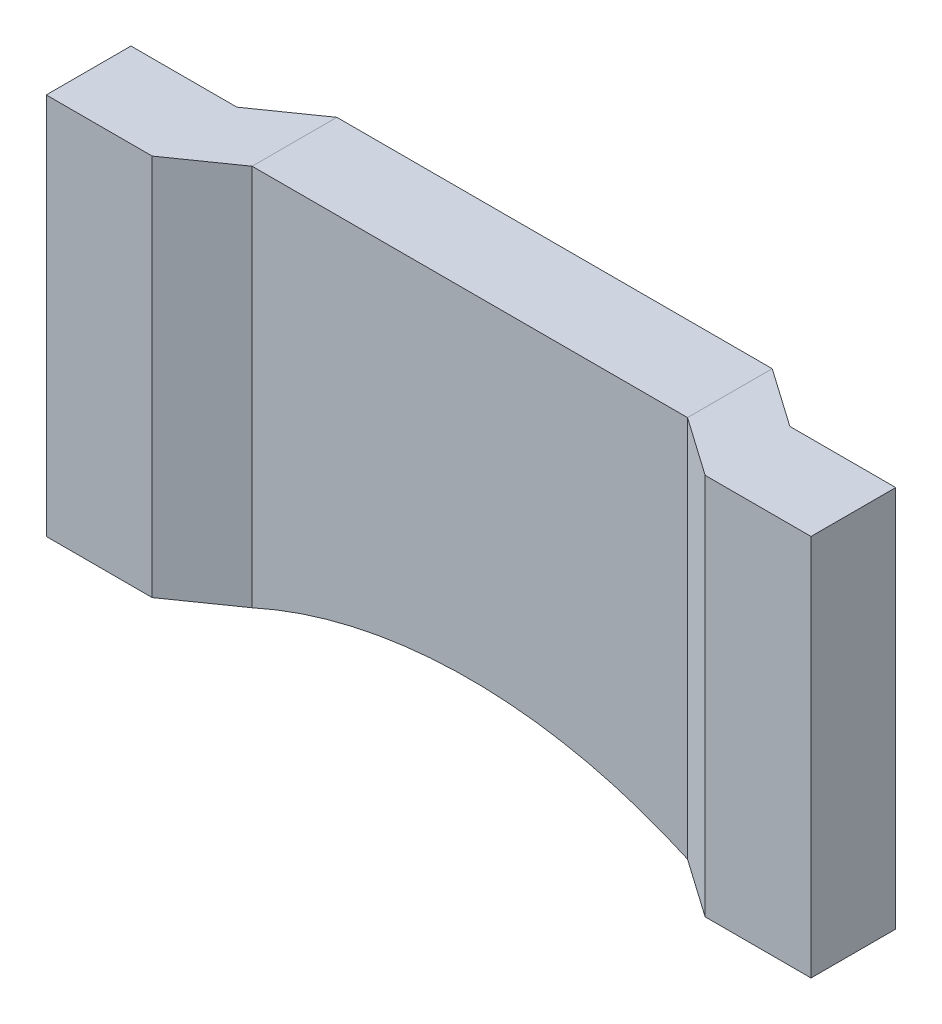
ISO-10303-21;
HEADER;
FILE_DESCRIPTION(('STEP AP214'),'2;1');
FILE_NAME('part.step','',(''),(''),'','','');
FILE_SCHEMA(('AUTOMOTIVE_DESIGN { 1 0 10303 214 1 1 1 1 }'));
ENDSEC;
DATA;
#1=APPLICATION_CONTEXT('core data for automotive mechanical design processes');
#2=APPLICATION_PROTOCOL_DEFINITION('international standard','automotive_design',2000,#1);
#3=PRODUCT_CONTEXT('',#1,'mechanical');
#4=PRODUCT('Part','Part','',(#3));
#5=PRODUCT_RELATED_PRODUCT_CATEGORY('part','',(#4));
#6=PRODUCT_DEFINITION_FORMATION('','',#4);
#7=PRODUCT_DEFINITION_CONTEXT('part definition',#1,'design');
#8=PRODUCT_DEFINITION('design','',#6,#7);
#9=PRODUCT_DEFINITION_SHAPE('','',#8);
#10=(LENGTH_UNIT() NAMED_UNIT(*) SI_UNIT(.MILLI.,.METRE.));
#11=(NAMED_UNIT(*) PLANE_ANGLE_UNIT() SI_UNIT($,.RADIAN.));
#12=(NAMED_UNIT(*) SI_UNIT($,.STERADIAN.) SOLID_ANGLE_UNIT());
#13=UNCERTAINTY_MEASURE_WITH_UNIT(LENGTH_MEASURE(1.E-05),#10,'distance_accuracy_value','');
#14=(GEOMETRIC_REPRESENTATION_CONTEXT(3) GLOBAL_UNCERTAINTY_ASSIGNED_CONTEXT((#13)) GLOBAL_UNIT_ASSIGNED_CONTEXT((#10,
#11,#12)) REPRESENTATION_CONTEXT('',''));
#15=CARTESIAN_POINT('',(0.,0.,0.));
#16=DIRECTION('',(0.,0.,1.));
#17=DIRECTION('',(1.,0.,0.));
#18=AXIS2_PLACEMENT_3D('',#15,#16,#17);
#19=CARTESIAN_POINT('',(19.8721310893276,-6.80902815420886,-0.547780344865948));
#20=DIRECTION('',(-8.74227765734793E-08,-1.,-4.37114091299597E-08));
#21=DIRECTION('',(-1.,8.74227765734794E-08,0.));
#22=AXIS2_PLACEMENT_3D('',#19,#20,#21);
#23=PLANE('',#22);
#24=DIRECTION('',(0.819152044289011,-4.6540711870944E-08,-0.573576436351015));
#25=VECTOR('',#24,1.);
#26=CARTESIAN_POINT('',(19.6222051881476,-6.80902812427303,-0.732780344865945));
#27=LINE('',#26,#25);
#28=CARTESIAN_POINT('',(19.6222051881476,-6.80902812427303,-0.732780344865945));
#29=VERTEX_POINT('',#28);
#30=CARTESIAN_POINT('',(20.1220569905076,-6.80902815267248,-1.08278034486595));
#31=VERTEX_POINT('',#30);
#32=EDGE_CURVE('P0_E27',#29,#31,#27,.T.);
#33=ORIENTED_EDGE('',*,*,#32,.F.);
#34=DIRECTION('',(1.,-8.74227765734794E-08,0.));
#35=VECTOR('',#34,1.);
#36=CARTESIAN_POINT('',(18.7222051881476,-6.80902804559254,-0.732780344865939));
#37=LINE('',#36,#35);
#38=CARTESIAN_POINT('',(18.7222051881476,-6.80902804559254,-0.732780344865939));
#39=VERTEX_POINT('',#38);
#40=EDGE_CURVE('P0_E147',#39,#29,#37,.T.);
#41=ORIENTED_EDGE('',*,*,#40,.F.);
#42=DIRECTION('',(0.,4.37114091299602E-08,-1.));
#43=VECTOR('',#42,1.);
#44=CARTESIAN_POINT('',(18.7222051881476,-6.80902807706475,-0.0127803448659405));
#45=LINE('',#44,#43);
#46=CARTESIAN_POINT('',(18.7222051881476,-6.80902807706475,-0.0127803448659405));
#47=VERTEX_POINT('',#46);
#48=EDGE_CURVE('P0_E65',#47,#39,#45,.T.);
#49=ORIENTED_EDGE('',*,*,#48,.F.);
#50=DIRECTION('',(-1.,8.74227765734794E-08,0.));
#51=VECTOR('',#50,1.);
#52=CARTESIAN_POINT('',(19.6222051881476,-6.80902815574525,-0.0127803448659474));
#53=LINE('',#52,#51);
#54=CARTESIAN_POINT('',(19.6222051881476,-6.80902815574525,-0.0127803448659474));
#55=VERTEX_POINT('',#54);
#56=EDGE_CURVE('P0_E157',#55,#47,#53,.T.);
#57=ORIENTED_EDGE('',*,*,#56,.F.);
#58=DIRECTION('',(-0.819152044289011,4.6540711870944E-08,0.573576436351015));
#59=VECTOR('',#58,1.);
#60=CARTESIAN_POINT('',(20.1220569905076,-6.80902818414469,-0.36278034486595));
#61=LINE('',#60,#59);
#62=CARTESIAN_POINT('',(20.1220569905076,-6.80902818414469,-0.36278034486595));
#63=VERTEX_POINT('',#62);
#64=EDGE_CURVE('P0_E115',#63,#55,#61,.T.);
#65=ORIENTED_EDGE('',*,*,#64,.F.);
#66=DIRECTION('',(0.,-4.37114091299602E-08,1.));
#67=VECTOR('',#66,1.);
#68=CARTESIAN_POINT('',(20.1220569905076,-6.80902815267248,-1.08278034486595));
#69=LINE('',#68,#67);
#70=EDGE_CURVE('P0_E101',#31,#63,#69,.T.);
#71=ORIENTED_EDGE('',*,*,#70,.F.);
#72=EDGE_LOOP('',(#33,#41,#49,#57,#65,#71));
#73=FACE_BOUND('',#72,.T.);
#74=ADVANCED_FACE('P0_F17',(#73),#23,.F.);
#75=CARTESIAN_POINT('',(19.8721308052035,-10.0590281542088,-0.547780486928027));
#76=DIRECTION('',(-8.74227765734793E-08,-1.,-4.37114091299597E-08));
#77=DIRECTION('',(-1.,8.74227765734794E-08,0.));
#78=AXIS2_PLACEMENT_3D('',#75,#76,#77);
#79=PLANE('',#78);
#80=DIRECTION('',(0.819152044289011,-4.6540711870944E-08,-0.573576436351015));
#81=VECTOR('',#80,1.);
#82=CARTESIAN_POINT('',(19.6222049040236,-10.059028124273,-0.732780486928025));
#83=LINE('',#82,#81);
#84=CARTESIAN_POINT('',(19.6222049040236,-10.059028124273,-0.732780486928025));
#85=VERTEX_POINT('',#84);
#86=CARTESIAN_POINT('',(20.1220567063836,-10.0590281526725,-1.08278048692803));
#87=VERTEX_POINT('',#86);
#88=EDGE_CURVE('P0_E11',#85,#87,#83,.T.);
#89=ORIENTED_EDGE('',*,*,#88,.T.);
#90=DIRECTION('',(0.,-4.37114091299602E-08,1.));
#91=VECTOR('',#90,1.);
#92=CARTESIAN_POINT('',(20.1220567063836,-10.0590281526725,-1.08278048692803));
#93=LINE('',#92,#91);
#94=CARTESIAN_POINT('',(20.1220567063836,-10.0590281841447,-0.36278048692803));
#95=VERTEX_POINT('',#94);
#96=EDGE_CURVE('P0_E90',#87,#95,#93,.T.);
#97=ORIENTED_EDGE('',*,*,#96,.T.);
#98=DIRECTION('',(-0.819152044289011,4.6540711870944E-08,0.573576436351015));
#99=VECTOR('',#98,1.);
#100=CARTESIAN_POINT('',(20.1220567063836,-10.0590281841447,-0.36278048692803));
#101=LINE('',#100,#99);
#102=CARTESIAN_POINT('',(19.6222049040236,-10.0590281557452,-0.0127804869280274));
#103=VERTEX_POINT('',#102);
#104=EDGE_CURVE('P0_E95',#95,#103,#101,.T.);
#105=ORIENTED_EDGE('',*,*,#104,.T.);
#106=DIRECTION('',(-1.,8.74227765734794E-08,0.));
#107=VECTOR('',#106,1.);
#108=CARTESIAN_POINT('',(19.6222049040236,-10.0590281557452,-0.0127804869280274));
#109=LINE('',#108,#107);
#110=CARTESIAN_POINT('',(18.7222049040235,-10.0590280770647,-0.0127804869280205));
#111=VERTEX_POINT('',#110);
#112=EDGE_CURVE('P0_E126',#103,#111,#109,.T.);
#113=ORIENTED_EDGE('',*,*,#112,.T.);
#114=DIRECTION('',(0.,4.37114091299602E-08,-1.));
#115=VECTOR('',#114,1.);
#116=CARTESIAN_POINT('',(18.7222049040235,-10.0590280770647,-0.0127804869280205));
#117=LINE('',#116,#115);
#118=CARTESIAN_POINT('',(18.7222049040235,-10.0590280455925,-0.732780486928018));
#119=VERTEX_POINT('',#118);
#120=EDGE_CURVE('P0_E119',#111,#119,#117,.T.);
#121=ORIENTED_EDGE('',*,*,#120,.T.);
#122=DIRECTION('',(1.,-8.74227765734794E-08,0.));
#123=VECTOR('',#122,1.);
#124=CARTESIAN_POINT('',(18.7222049040235,-10.0590280455925,-0.732780486928018));
#125=LINE('',#124,#123);
#126=EDGE_CURVE('P0_E136',#119,#85,#125,.T.);
#127=ORIENTED_EDGE('',*,*,#126,.T.);
#128=EDGE_LOOP('',(#89,#97,#105,#113,#121,#127));
#129=FACE_BOUND('',#128,.T.);
#130=ADVANCED_FACE('P0_F92',(#129),#79,.T.);
#131=CARTESIAN_POINT('',(19.6222051881476,-6.80902812427303,-0.732780344865945));
#132=DIRECTION('',(-0.573576436351012,8.59499347904874E-08,-0.819152044289009));
#133=DIRECTION('',(0.819152044289011,-4.6540711870944E-08,-0.573576436351015));
#134=AXIS2_PLACEMENT_3D('',#131,#132,#133);
#135=PLANE('',#134);
#136=ORIENTED_EDGE('',*,*,#32,.T.);
#137=DIRECTION('',(-8.74227765734793E-08,-1.,-4.37114091299597E-08));
#138=VECTOR('',#137,1.);
#139=CARTESIAN_POINT('',(20.1220569905076,-6.80902815267248,-1.08278034486595));
#140=LINE('',#139,#138);
#141=EDGE_CURVE('P0_E100',#31,#87,#140,.T.);
#142=ORIENTED_EDGE('',*,*,#141,.T.);
#143=ORIENTED_EDGE('',*,*,#88,.F.);
#144=DIRECTION('',(-8.74227765734793E-08,-1.,-4.37114091299597E-08));
#145=VECTOR('',#144,1.);
#146=CARTESIAN_POINT('',(19.6222051881476,-6.80902812427303,-0.732780344865945));
#147=LINE('',#146,#145);
#148=EDGE_CURVE('P0_E140',#29,#85,#147,.T.);
#149=ORIENTED_EDGE('',*,*,#148,.F.);
#150=EDGE_LOOP('',(#136,#142,#143,#149));
#151=FACE_BOUND('',#150,.T.);
#152=ADVANCED_FACE('P0_F195',(#151),#135,.T.);
#153=CARTESIAN_POINT('',(20.1220569905076,-6.80902815267248,-1.08278034486595));
#154=DIRECTION('',(1.,-8.74227765734794E-08,0.));
#155=DIRECTION('',(0.,-4.37114091299602E-08,1.));
#156=AXIS2_PLACEMENT_3D('',#153,#154,#155);
#157=PLANE('',#156);
#158=ORIENTED_EDGE('',*,*,#70,.T.);
#159=DIRECTION('',(-8.74227765734793E-08,-1.,-4.37114091299597E-08));
#160=VECTOR('',#159,1.);
#161=CARTESIAN_POINT('',(20.1220569905076,-6.80902818414469,-0.36278034486595));
#162=LINE('',#161,#160);
#163=EDGE_CURVE('P0_E104',#63,#95,#162,.T.);
#164=ORIENTED_EDGE('',*,*,#163,.T.);
#165=ORIENTED_EDGE('',*,*,#96,.F.);
#166=ORIENTED_EDGE('',*,*,#141,.F.);
#167=EDGE_LOOP('',(#158,#164,#165,#166));
#168=FACE_BOUND('',#167,.T.);
#169=ADVANCED_FACE('P0_F105',(#168),#157,.T.);
#170=CARTESIAN_POINT('',(20.1220569905076,-6.80902818414469,-0.36278034486595));
#171=DIRECTION('',(0.573576436351012,-8.59499347904874E-08,0.819152044289009));
#172=DIRECTION('',(-0.819152044289011,4.6540711870944E-08,0.573576436351015));
#173=AXIS2_PLACEMENT_3D('',#170,#171,#172);
#174=PLANE('',#173);
#175=ORIENTED_EDGE('',*,*,#64,.T.);
#176=DIRECTION('',(-8.74227765734793E-08,-1.,-4.37114091299597E-08));
#177=VECTOR('',#176,1.);
#178=CARTESIAN_POINT('',(19.6222051881476,-6.80902815574525,-0.0127803448659474));
#179=LINE('',#178,#177);
#180=EDGE_CURVE('P0_E112',#55,#103,#179,.T.);
#181=ORIENTED_EDGE('',*,*,#180,.T.);
#182=ORIENTED_EDGE('',*,*,#104,.F.);
#183=ORIENTED_EDGE('',*,*,#163,.F.);
#184=EDGE_LOOP('',(#175,#181,#182,#183));
#185=FACE_BOUND('',#184,.T.);
#186=ADVANCED_FACE('P0_F110',(#185),#174,.T.);
#187=CARTESIAN_POINT('',(18.7222051881476,-6.80902807706475,-0.0127803448659405));
#188=DIRECTION('',(-1.,8.74227765734794E-08,0.));
#189=DIRECTION('',(0.,4.37114091299602E-08,-1.));
#190=AXIS2_PLACEMENT_3D('',#187,#188,#189);
#191=PLANE('',#190);
#192=ORIENTED_EDGE('',*,*,#48,.T.);
#193=DIRECTION('',(-8.74227765734793E-08,-1.,-4.37114091299597E-08));
#194=VECTOR('',#193,1.);
#195=CARTESIAN_POINT('',(18.7222051881476,-6.80902804559254,-0.732780344865939));
#196=LINE('',#195,#194);
#197=EDGE_CURVE('P0_E139',#39,#119,#196,.T.);
#198=ORIENTED_EDGE('',*,*,#197,.T.);
#199=ORIENTED_EDGE('',*,*,#120,.F.);
#200=DIRECTION('',(-8.74227765734793E-08,-1.,-4.37114091299597E-08));
#201=VECTOR('',#200,1.);
#202=CARTESIAN_POINT('',(18.7222051881476,-6.80902807706475,-0.0127803448659405));
#203=LINE('',#202,#201);
#204=EDGE_CURVE('P0_E129',#47,#111,#203,.T.);
#205=ORIENTED_EDGE('',*,*,#204,.F.);
#206=EDGE_LOOP('',(#192,#198,#199,#205));
#207=FACE_BOUND('',#206,.T.);
#208=ADVANCED_FACE('P0_F197',(#207),#191,.T.);
#209=CARTESIAN_POINT('',(18.7222051881476,-6.80902804559254,-0.732780344865939));
#210=DIRECTION('',(0.,4.37114091299602E-08,-1.));
#211=DIRECTION('',(1.,-8.74227765734794E-08,0.));
#212=AXIS2_PLACEMENT_3D('',#209,#210,#211);
#213=PLANE('',#212);
#214=ORIENTED_EDGE('',*,*,#40,.T.);
#215=ORIENTED_EDGE('',*,*,#148,.T.);
#216=ORIENTED_EDGE('',*,*,#126,.F.);
#217=ORIENTED_EDGE('',*,*,#197,.F.);
#218=EDGE_LOOP('',(#214,#215,#216,#217));
#219=FACE_BOUND('',#218,.T.);
#220=ADVANCED_FACE('P0_F194',(#219),#213,.T.);
#221=CARTESIAN_POINT('',(19.6222051881476,-6.80902815574525,-0.0127803448659474));
#222=DIRECTION('',(0.,-4.37114091299602E-08,1.));
#223=DIRECTION('',(-1.,8.74227765734794E-08,0.));
#224=AXIS2_PLACEMENT_3D('',#221,#222,#223);
#225=PLANE('',#224);
#226=ORIENTED_EDGE('',*,*,#56,.T.);
#227=ORIENTED_EDGE('',*,*,#204,.T.);
#228=ORIENTED_EDGE('',*,*,#112,.F.);
#229=ORIENTED_EDGE('',*,*,#180,.F.);
#230=EDGE_LOOP('',(#226,#227,#228,#229));
#231=FACE_BOUND('',#230,.T.);
#232=ADVANCED_FACE('P0_F268',(#231),#225,.T.);
#233=CLOSED_SHELL('',(#74,#130,#152,#169,#186,#208,#220,#232));
#234=MANIFOLD_SOLID_BREP('P0_B1',#233);
#235=CARTESIAN_POINT('',(24.0722792869676,-6.80902852139748,-0.54778034486598));
#236=DIRECTION('',(-8.74227765734793E-08,-1.,-4.37114091299597E-08));
#237=DIRECTION('',(-1.,8.74227765734794E-08,0.));
#238=AXIS2_PLACEMENT_3D('',#235,#236,#237);
#239=PLANE('',#238);
#240=DIRECTION('',(0.819152044289016,-9.66843804242312E-08,0.573576436351003));
#241=VECTOR('',#240,1.);
#242=CARTESIAN_POINT('',(23.8223533857876,-6.80902847616266,-1.08278034486598));
#243=LINE('',#242,#241);
#244=CARTESIAN_POINT('',(23.8223533857876,-6.80902847616266,-1.08278034486598));
#245=VERTEX_POINT('',#244);
#246=CARTESIAN_POINT('',(24.3222051881475,-6.80902853516008,-0.732780344865981));
#247=VERTEX_POINT('',#246);
#248=EDGE_CURVE('P1_E96',#245,#247,#243,.T.);
#249=ORIENTED_EDGE('',*,*,#248,.F.);
#250=DIRECTION('',(0.,4.37114091299602E-08,-1.));
#251=VECTOR('',#250,1.);
#252=CARTESIAN_POINT('',(23.8223533857876,-6.80902850763487,-0.362780344865978));
#253=LINE('',#252,#251);
#254=CARTESIAN_POINT('',(23.8223533857876,-6.80902850763487,-0.362780344865978));
#255=VERTEX_POINT('',#254);
#256=EDGE_CURVE('P1_E82',#255,#245,#253,.T.);
#257=ORIENTED_EDGE('',*,*,#256,.F.);
#258=DIRECTION('',(-0.819152044289016,9.66843804242312E-08,-0.573576436351003));
#259=VECTOR('',#258,1.);
#260=CARTESIAN_POINT('',(24.3222051881476,-6.80902856663231,-0.0127803448659834));
#261=LINE('',#260,#259);
#262=CARTESIAN_POINT('',(24.3222051881476,-6.80902856663231,-0.0127803448659834));
#263=VERTEX_POINT('',#262);
#264=EDGE_CURVE('P1_E27',#263,#255,#261,.T.);
#265=ORIENTED_EDGE('',*,*,#264,.F.);
#266=DIRECTION('',(-1.,8.74227765734794E-08,0.));
#267=VECTOR('',#266,1.);
#268=CARTESIAN_POINT('',(25.2222051881476,-6.8090286453128,-0.0127803448659904));
#269=LINE('',#268,#267);
#270=CARTESIAN_POINT('',(25.2222051881476,-6.8090286453128,-0.0127803448659904));
#271=VERTEX_POINT('',#270);
#272=EDGE_CURVE('P1_E136',#271,#263,#269,.T.);
#273=ORIENTED_EDGE('',*,*,#272,.F.);
#274=DIRECTION('',(0.,-4.37114091299602E-08,1.));
#275=VECTOR('',#274,1.);
#276=CARTESIAN_POINT('',(25.2222051881476,-6.80902861384058,-0.732780344865988));
#277=LINE('',#276,#275);
#278=CARTESIAN_POINT('',(25.2222051881476,-6.80902861384058,-0.732780344865988));
#279=VERTEX_POINT('',#278);
#280=EDGE_CURVE('P1_E142',#279,#271,#277,.T.);
#281=ORIENTED_EDGE('',*,*,#280,.F.);
#282=DIRECTION('',(1.,-8.74227765734794E-08,0.));
#283=VECTOR('',#282,1.);
#284=CARTESIAN_POINT('',(24.3222051881475,-6.80902853516008,-0.732780344865981));
#285=LINE('',#284,#283);
#286=EDGE_CURVE('P1_E110',#247,#279,#285,.T.);
#287=ORIENTED_EDGE('',*,*,#286,.F.);
#288=EDGE_LOOP('',(#249,#257,#265,#273,#281,#287));
#289=FACE_BOUND('',#288,.T.);
#290=ADVANCED_FACE('P1_F17',(#289),#239,.F.);
#291=CARTESIAN_POINT('',(24.0722790028435,-10.0590285213975,-0.547780486928059));
#292=DIRECTION('',(-8.74227765734793E-08,-1.,-4.37114091299597E-08));
#293=DIRECTION('',(-1.,8.74227765734794E-08,0.));
#294=AXIS2_PLACEMENT_3D('',#291,#292,#293);
#295=PLANE('',#294);
#296=DIRECTION('',(-0.819152044289016,9.66843804242312E-08,-0.573576436351003));
#297=VECTOR('',#296,1.);
#298=CARTESIAN_POINT('',(24.3222049040236,-10.0590285666323,-0.012780486928063));
#299=LINE('',#298,#297);
#300=CARTESIAN_POINT('',(24.3222049040236,-10.0590285666323,-0.012780486928063));
#301=VERTEX_POINT('',#300);
#302=CARTESIAN_POINT('',(23.8223531016635,-10.0590285076349,-0.362780486928059));
#303=VERTEX_POINT('',#302);
#304=EDGE_CURVE('P1_E11',#301,#303,#299,.T.);
#305=ORIENTED_EDGE('',*,*,#304,.T.);
#306=DIRECTION('',(0.,4.37114091299602E-08,-1.));
#307=VECTOR('',#306,1.);
#308=CARTESIAN_POINT('',(23.8223531016635,-10.0590285076349,-0.362780486928059));
#309=LINE('',#308,#307);
#310=CARTESIAN_POINT('',(23.8223531016635,-10.0590284761626,-1.08278048692806));
#311=VERTEX_POINT('',#310);
#312=EDGE_CURVE('P1_E75',#303,#311,#309,.T.);
#313=ORIENTED_EDGE('',*,*,#312,.T.);
#314=DIRECTION('',(0.819152044289016,-9.66843804242312E-08,0.573576436351003));
#315=VECTOR('',#314,1.);
#316=CARTESIAN_POINT('',(23.8223531016635,-10.0590284761626,-1.08278048692806));
#317=LINE('',#316,#315);
#318=CARTESIAN_POINT('',(24.3222049040236,-10.0590285351601,-0.732780486928061));
#319=VERTEX_POINT('',#318);
#320=EDGE_CURVE('P1_E63',#311,#319,#317,.T.);
#321=ORIENTED_EDGE('',*,*,#320,.T.);
#322=DIRECTION('',(1.,-8.74227765734794E-08,0.));
#323=VECTOR('',#322,1.);
#324=CARTESIAN_POINT('',(24.3222049040236,-10.0590285351601,-0.732780486928061));
#325=LINE('',#324,#323);
#326=CARTESIAN_POINT('',(25.2222049040235,-10.0590286138406,-0.732780486928068));
#327=VERTEX_POINT('',#326);
#328=EDGE_CURVE('P1_E107',#319,#327,#325,.T.);
#329=ORIENTED_EDGE('',*,*,#328,.T.);
#330=DIRECTION('',(0.,-4.37114091299602E-08,1.));
#331=VECTOR('',#330,1.);
#332=CARTESIAN_POINT('',(25.2222049040235,-10.0590286138406,-0.732780486928068));
#333=LINE('',#332,#331);
#334=CARTESIAN_POINT('',(25.2222049040235,-10.0590286453128,-0.0127804869280699));
#335=VERTEX_POINT('',#334);
#336=EDGE_CURVE('P1_E113',#327,#335,#333,.T.);
#337=ORIENTED_EDGE('',*,*,#336,.T.);
#338=DIRECTION('',(-1.,8.74227765734794E-08,0.));
#339=VECTOR('',#338,1.);
#340=CARTESIAN_POINT('',(25.2222049040235,-10.0590286453128,-0.0127804869280699));
#341=LINE('',#340,#339);
#342=EDGE_CURVE('P1_E100',#335,#301,#341,.T.);
#343=ORIENTED_EDGE('',*,*,#342,.T.);
#344=EDGE_LOOP('',(#305,#313,#321,#329,#337,#343));
#345=FACE_BOUND('',#344,.T.);
#346=ADVANCED_FACE('P1_F77',(#345),#295,.T.);
#347=CARTESIAN_POINT('',(24.3222051881476,-6.80902856663231,-0.0127803448659834));
#348=DIRECTION('',(-0.573576436351006,1.43373544953665E-08,0.819152044289018));
#349=DIRECTION('',(-0.819152044289016,9.66843804242312E-08,-0.573576436351003));
#350=AXIS2_PLACEMENT_3D('',#347,#348,#349);
#351=PLANE('',#350);
#352=ORIENTED_EDGE('',*,*,#264,.T.);
#353=DIRECTION('',(-8.74227765734793E-08,-1.,-4.37114091299597E-08));
#354=VECTOR('',#353,1.);
#355=CARTESIAN_POINT('',(23.8223533857876,-6.80902850763487,-0.362780344865978));
#356=LINE('',#355,#354);
#357=EDGE_CURVE('P1_E81',#255,#303,#356,.T.);
#358=ORIENTED_EDGE('',*,*,#357,.T.);
#359=ORIENTED_EDGE('',*,*,#304,.F.);
#360=DIRECTION('',(-8.74227765734793E-08,-1.,-4.37114091299597E-08));
#361=VECTOR('',#360,1.);
#362=CARTESIAN_POINT('',(24.3222051881476,-6.80902856663231,-0.0127803448659834));
#363=LINE('',#362,#361);
#364=EDGE_CURVE('P1_E123',#263,#301,#363,.T.);
#365=ORIENTED_EDGE('',*,*,#364,.F.);
#366=EDGE_LOOP('',(#352,#358,#359,#365));
#367=FACE_BOUND('',#366,.T.);
#368=ADVANCED_FACE('P1_F190',(#367),#351,.T.);
#369=CARTESIAN_POINT('',(23.8223533857876,-6.80902850763487,-0.362780344865978));
#370=DIRECTION('',(-1.,8.74227765734794E-08,0.));
#371=DIRECTION('',(0.,4.37114091299602E-08,-1.));
#372=AXIS2_PLACEMENT_3D('',#369,#370,#371);
#373=PLANE('',#372);
#374=ORIENTED_EDGE('',*,*,#256,.T.);
#375=DIRECTION('',(-8.74227765734793E-08,-1.,-4.37114091299597E-08));
#376=VECTOR('',#375,1.);
#377=CARTESIAN_POINT('',(23.8223533857876,-6.80902847616266,-1.08278034486598));
#378=LINE('',#377,#376);
#379=EDGE_CURVE('P1_E85',#245,#311,#378,.T.);
#380=ORIENTED_EDGE('',*,*,#379,.T.);
#381=ORIENTED_EDGE('',*,*,#312,.F.);
#382=ORIENTED_EDGE('',*,*,#357,.F.);
#383=EDGE_LOOP('',(#374,#380,#381,#382));
#384=FACE_BOUND('',#383,.T.);
#385=ADVANCED_FACE('P1_F86',(#384),#373,.T.);
#386=CARTESIAN_POINT('',(23.8223533857876,-6.80902847616266,-1.08278034486598));
#387=DIRECTION('',(0.573576436351006,-1.43373544953665E-08,-0.819152044289018));
#388=DIRECTION('',(0.819152044289016,-9.66843804242312E-08,0.573576436351003));
#389=AXIS2_PLACEMENT_3D('',#386,#387,#388);
#390=PLANE('',#389);
#391=ORIENTED_EDGE('',*,*,#248,.T.);
#392=DIRECTION('',(-8.74227765734793E-08,-1.,-4.37114091299597E-08));
#393=VECTOR('',#392,1.);
#394=CARTESIAN_POINT('',(24.3222051881475,-6.80902853516008,-0.732780344865981));
#395=LINE('',#394,#393);
#396=EDGE_CURVE('P1_E93',#247,#319,#395,.T.);
#397=ORIENTED_EDGE('',*,*,#396,.T.);
#398=ORIENTED_EDGE('',*,*,#320,.F.);
#399=ORIENTED_EDGE('',*,*,#379,.F.);
#400=EDGE_LOOP('',(#391,#397,#398,#399));
#401=FACE_BOUND('',#400,.T.);
#402=ADVANCED_FACE('P1_F91',(#401),#390,.T.);
#403=CARTESIAN_POINT('',(25.2222051881476,-6.8090286453128,-0.0127803448659904));
#404=DIRECTION('',(0.,-4.37114091299602E-08,1.));
#405=DIRECTION('',(-1.,8.74227765734794E-08,0.));
#406=AXIS2_PLACEMENT_3D('',#403,#404,#405);
#407=PLANE('',#406);
#408=ORIENTED_EDGE('',*,*,#272,.T.);
#409=ORIENTED_EDGE('',*,*,#364,.T.);
#410=ORIENTED_EDGE('',*,*,#342,.F.);
#411=DIRECTION('',(-8.74227765734793E-08,-1.,-4.37114091299597E-08));
#412=VECTOR('',#411,1.);
#413=CARTESIAN_POINT('',(25.2222051881476,-6.8090286453128,-0.0127803448659904));
#414=LINE('',#413,#412);
#415=EDGE_CURVE('P1_E118',#271,#335,#414,.T.);
#416=ORIENTED_EDGE('',*,*,#415,.F.);
#417=EDGE_LOOP('',(#408,#409,#410,#416));
#418=FACE_BOUND('',#417,.T.);
#419=ADVANCED_FACE('P1_F186',(#418),#407,.T.);
#420=CARTESIAN_POINT('',(24.3222051881475,-6.80902853516008,-0.732780344865981));
#421=DIRECTION('',(0.,4.37114091299602E-08,-1.));
#422=DIRECTION('',(1.,-8.74227765734794E-08,0.));
#423=AXIS2_PLACEMENT_3D('',#420,#421,#422);
#424=PLANE('',#423);
#425=ORIENTED_EDGE('',*,*,#286,.T.);
#426=DIRECTION('',(-8.74227765734793E-08,-1.,-4.37114091299597E-08));
#427=VECTOR('',#426,1.);
#428=CARTESIAN_POINT('',(25.2222051881476,-6.80902861384058,-0.732780344865988));
#429=LINE('',#428,#427);
#430=EDGE_CURVE('P1_E117',#279,#327,#429,.T.);
#431=ORIENTED_EDGE('',*,*,#430,.T.);
#432=ORIENTED_EDGE('',*,*,#328,.F.);
#433=ORIENTED_EDGE('',*,*,#396,.F.);
#434=EDGE_LOOP('',(#425,#431,#432,#433));
#435=FACE_BOUND('',#434,.T.);
#436=ADVANCED_FACE('P1_F215',(#435),#424,.T.);
#437=CARTESIAN_POINT('',(25.2222051881476,-6.80902861384058,-0.732780344865988));
#438=DIRECTION('',(1.,-8.74227765734794E-08,0.));
#439=DIRECTION('',(0.,-4.37114091299602E-08,1.));
#440=AXIS2_PLACEMENT_3D('',#437,#438,#439);
#441=PLANE('',#440);
#442=ORIENTED_EDGE('',*,*,#280,.T.);
#443=ORIENTED_EDGE('',*,*,#415,.T.);
#444=ORIENTED_EDGE('',*,*,#336,.F.);
#445=ORIENTED_EDGE('',*,*,#430,.F.);
#446=EDGE_LOOP('',(#442,#443,#444,#445));
#447=FACE_BOUND('',#446,.T.);
#448=ADVANCED_FACE('P1_F194',(#447),#441,.T.);
#449=CLOSED_SHELL('',(#290,#346,#368,#385,#402,#419,#436,#448));
#450=MANIFOLD_SOLID_BREP('P1_B1',#449);
#451=CARTESIAN_POINT('',(21.9722051881476,-6.80902833015368,-0.722780344865964));
#452=DIRECTION('',(8.74227765734793E-08,1.,4.37114091299597E-08));
#453=DIRECTION('',(1.,-8.74227765734794E-08,0.));
#454=AXIS2_PLACEMENT_3D('',#451,#452,#453);
#455=PLANE('',#454);
#456=DIRECTION('',(-1.,8.74227765734794E-08,0.));
#457=VECTOR('',#456,1.);
#458=CARTESIAN_POINT('',(23.8223533857876,-6.80902847616266,-1.08278034486598));
#459=LINE('',#458,#457);
#460=CARTESIAN_POINT('',(23.8223533857876,-6.80902847616266,-1.08278034486598));
#461=VERTEX_POINT('',#460);
#462=CARTESIAN_POINT('',(20.1220569905076,-6.80902815267248,-1.08278034486595));
#463=VERTEX_POINT('',#462);
#464=EDGE_CURVE('P2_E11',#461,#463,#459,.T.);
#465=ORIENTED_EDGE('',*,*,#464,.T.);
#466=DIRECTION('',(0.,-4.37114091299602E-08,1.));
#467=VECTOR('',#466,1.);
#468=CARTESIAN_POINT('',(20.1220569905076,-6.80902815267248,-1.08278034486595));
#469=LINE('',#468,#467);
#470=CARTESIAN_POINT('',(20.1220569905076,-6.80902818414469,-0.36278034486595));
#471=VERTEX_POINT('',#470);
#472=EDGE_CURVE('P2_E118',#463,#471,#469,.T.);
#473=ORIENTED_EDGE('',*,*,#472,.T.);
#474=DIRECTION('',(1.,-8.74227765734794E-08,0.));
#475=VECTOR('',#474,1.);
#476=CARTESIAN_POINT('',(20.1220569905076,-6.80902818414469,-0.36278034486595));
#477=LINE('',#476,#475);
#478=CARTESIAN_POINT('',(23.8223533857876,-6.80902850763487,-0.362780344865978));
#479=VERTEX_POINT('',#478);
#480=EDGE_CURVE('P2_E73',#471,#479,#477,.T.);
#481=ORIENTED_EDGE('',*,*,#480,.T.);
#482=DIRECTION('',(0.,4.37114091299602E-08,-1.));
#483=VECTOR('',#482,1.);
#484=CARTESIAN_POINT('',(23.8223533857876,-6.80902850763487,-0.362780344865978));
#485=LINE('',#484,#483);
#486=EDGE_CURVE('P2_E124',#479,#461,#485,.T.);
#487=ORIENTED_EDGE('',*,*,#486,.T.);
#488=EDGE_LOOP('',(#465,#473,#481,#487));
#489=FACE_BOUND('',#488,.T.);
#490=ADVANCED_FACE('P2_F17',(#489),#455,.T.);
#491=CARTESIAN_POINT('',(23.8223531016635,-10.0590284761626,-1.08278048692806));
#492=DIRECTION('',(0.,4.37114091299602E-08,-1.));
#493=DIRECTION('',(-1.,8.74227765734794E-08,0.));
#494=AXIS2_PLACEMENT_3D('',#491,#492,#493);
#495=PLANE('',#494);
#496=CARTESIAN_POINT('',(21.9722045474426,-14.1378387559565,-1.08278066521859));
#497=DIRECTION('',(0.,-4.37114091299602E-08,1.));
#498=DIRECTION('',(-0.413089114890717,0.910690607812997,3.98075713274905E-08));
#499=AXIS2_PLACEMENT_3D('',#496,#497,#498);
#500=CIRCLE('',#499,4.478810441539);
#501=CARTESIAN_POINT('',(23.8223531016635,-10.0590284761626,-1.08278048692806));
#502=VERTEX_POINT('',#501);
#503=CARTESIAN_POINT('',(20.1220567063836,-10.0590281526725,-1.08278048692803));
#504=VERTEX_POINT('',#503);
#505=EDGE_CURVE('P2_E86',#502,#504,#500,.T.);
#506=ORIENTED_EDGE('',*,*,#505,.T.);
#507=DIRECTION('',(8.74227765734793E-08,1.,4.37114091299597E-08));
#508=VECTOR('',#507,1.);
#509=CARTESIAN_POINT('',(20.1220567063836,-10.0590281526725,-1.08278048692803));
#510=LINE('',#509,#508);
#511=EDGE_CURVE('P2_E27',#504,#463,#510,.T.);
#512=ORIENTED_EDGE('',*,*,#511,.T.);
#513=ORIENTED_EDGE('',*,*,#464,.F.);
#514=DIRECTION('',(8.74227765734793E-08,1.,4.37114091299597E-08));
#515=VECTOR('',#514,1.);
#516=CARTESIAN_POINT('',(23.8223531016635,-10.0590284761626,-1.08278048692806));
#517=LINE('',#516,#515);
#518=EDGE_CURVE('P2_E77',#502,#461,#517,.T.);
#519=ORIENTED_EDGE('',*,*,#518,.F.);
#520=EDGE_LOOP('',(#506,#512,#513,#519));
#521=FACE_BOUND('',#520,.T.);
#522=ADVANCED_FACE('P2_F141',(#521),#495,.T.);
#523=CARTESIAN_POINT('',(20.1220567063836,-10.0590281526725,-1.08278048692803));
#524=DIRECTION('',(-1.,8.74227765734794E-08,0.));
#525=DIRECTION('',(0.,-4.37114091299602E-08,1.));
#526=AXIS2_PLACEMENT_3D('',#523,#524,#525);
#527=PLANE('',#526);
#528=DIRECTION('',(0.,-4.37114091299602E-08,1.));
#529=VECTOR('',#528,1.);
#530=CARTESIAN_POINT('',(20.1220567063836,-10.0590281526725,-1.08278048692803));
#531=LINE('',#530,#529);
#532=CARTESIAN_POINT('',(20.1220567063836,-10.0590281841447,-0.36278048692803));
#533=VERTEX_POINT('',#532);
#534=EDGE_CURVE('P2_E80',#504,#533,#531,.T.);
#535=ORIENTED_EDGE('',*,*,#534,.T.);
#536=DIRECTION('',(8.74227765734793E-08,1.,4.37114091299597E-08));
#537=VECTOR('',#536,1.);
#538=CARTESIAN_POINT('',(20.1220567063836,-10.0590281841447,-0.36278048692803));
#539=LINE('',#538,#537);
#540=EDGE_CURVE('P2_E66',#533,#471,#539,.T.);
#541=ORIENTED_EDGE('',*,*,#540,.T.);
#542=ORIENTED_EDGE('',*,*,#472,.F.);
#543=ORIENTED_EDGE('',*,*,#511,.F.);
#544=EDGE_LOOP('',(#535,#541,#542,#543));
#545=FACE_BOUND('',#544,.T.);
#546=ADVANCED_FACE('P2_F81',(#545),#527,.T.);
#547=CARTESIAN_POINT('',(23.8223531016635,-10.0590285076349,-0.362780486928059));
#548=DIRECTION('',(1.,-8.74227765734794E-08,0.));
#549=DIRECTION('',(0.,4.37114091299602E-08,-1.));
#550=AXIS2_PLACEMENT_3D('',#547,#548,#549);
#551=PLANE('',#550);
#552=DIRECTION('',(0.,4.37114091299602E-08,-1.));
#553=VECTOR('',#552,1.);
#554=CARTESIAN_POINT('',(23.8223531016635,-10.0590285076349,-0.362780486928059));
#555=LINE('',#554,#553);
#556=CARTESIAN_POINT('',(23.8223531016635,-10.0590285076349,-0.362780486928059));
#557=VERTEX_POINT('',#556);
#558=EDGE_CURVE('P2_E91',#557,#502,#555,.T.);
#559=ORIENTED_EDGE('',*,*,#558,.T.);
#560=ORIENTED_EDGE('',*,*,#518,.T.);
#561=ORIENTED_EDGE('',*,*,#486,.F.);
#562=DIRECTION('',(8.74227765734793E-08,1.,4.37114091299597E-08));
#563=VECTOR('',#562,1.);
#564=CARTESIAN_POINT('',(23.8223531016635,-10.0590285076349,-0.362780486928059));
#565=LINE('',#564,#563);
#566=EDGE_CURVE('P2_E101',#557,#479,#565,.T.);
#567=ORIENTED_EDGE('',*,*,#566,.F.);
#568=EDGE_LOOP('',(#559,#560,#561,#567));
#569=FACE_BOUND('',#568,.T.);
#570=ADVANCED_FACE('P2_F139',(#569),#551,.T.);
#571=CARTESIAN_POINT('',(20.1220567063836,-10.0590281841447,-0.36278048692803));
#572=DIRECTION('',(0.,-4.37114091299602E-08,1.));
#573=DIRECTION('',(1.,-8.74227765734794E-08,0.));
#574=AXIS2_PLACEMENT_3D('',#571,#572,#573);
#575=PLANE('',#574);
#576=CARTESIAN_POINT('',(21.9722045474426,-14.1378387874288,-0.362780665218596));
#577=DIRECTION('',(0.,4.37114091299602E-08,-1.));
#578=DIRECTION('',(-0.413089114890717,0.910690607812997,3.98075713274905E-08));
#579=AXIS2_PLACEMENT_3D('',#576,#577,#578);
#580=CIRCLE('',#579,4.478810441539);
#581=EDGE_CURVE('P2_E71',#533,#557,#580,.T.);
#582=ORIENTED_EDGE('',*,*,#581,.T.);
#583=ORIENTED_EDGE('',*,*,#566,.T.);
#584=ORIENTED_EDGE('',*,*,#480,.F.);
#585=ORIENTED_EDGE('',*,*,#540,.F.);
#586=EDGE_LOOP('',(#582,#583,#584,#585));
#587=FACE_BOUND('',#586,.T.);
#588=ADVANCED_FACE('P2_F68',(#587),#575,.T.);
#589=CARTESIAN_POINT('',(21.9722045474426,-14.1378387559565,-1.08278066521859));
#590=DIRECTION('',(0.,-4.37114091299602E-08,1.));
#591=DIRECTION('',(-0.413089114890717,0.910690607812997,3.98075713274905E-08));
#592=AXIS2_PLACEMENT_3D('',#589,#590,#591);
#593=CYLINDRICAL_SURFACE('',#592,4.478810441539);
#594=ORIENTED_EDGE('',*,*,#581,.F.);
#595=ORIENTED_EDGE('',*,*,#534,.F.);
#596=ORIENTED_EDGE('',*,*,#505,.F.);
#597=ORIENTED_EDGE('',*,*,#558,.F.);
#598=EDGE_LOOP('',(#594,#595,#596,#597));
#599=FACE_BOUND('',#598,.T.);
#600=ADVANCED_FACE('P2_F89',(#599),#593,.F.);
#601=CLOSED_SHELL('',(#490,#522,#546,#570,#588,#600));
#602=MANIFOLD_SOLID_BREP('P2_B1',#601);
#603=ADVANCED_BREP_SHAPE_REPRESENTATION('',(#18,#234,#450,#602),#14);
#604=SHAPE_DEFINITION_REPRESENTATION(#9,#603);
ENDSEC;
END-ISO-10303-21;
